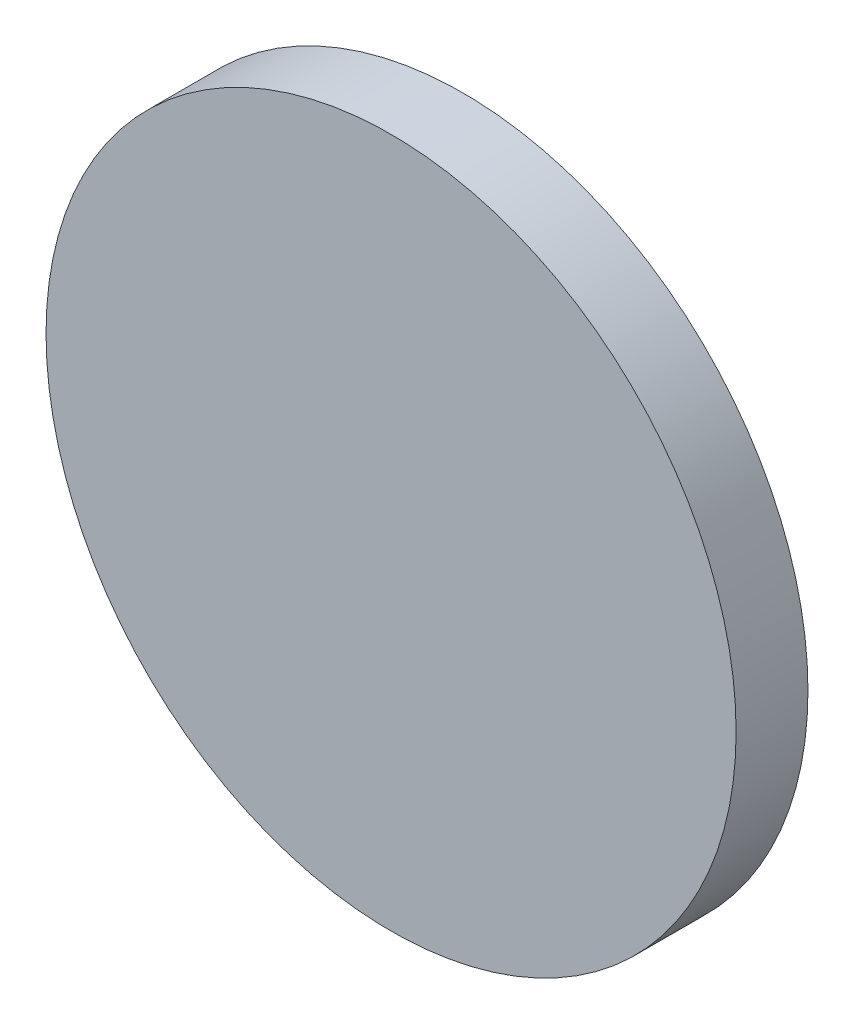
ISO-10303-21;
HEADER;
FILE_DESCRIPTION(('STEP AP214'),'2;1');
FILE_NAME('part.step','',(''),(''),'','','');
FILE_SCHEMA(('AUTOMOTIVE_DESIGN { 1 0 10303 214 1 1 1 1 }'));
ENDSEC;
DATA;
#1=APPLICATION_CONTEXT('core data for automotive mechanical design processes');
#2=APPLICATION_PROTOCOL_DEFINITION('international standard','automotive_design',2000,#1);
#3=PRODUCT_CONTEXT('',#1,'mechanical');
#4=PRODUCT('Part','Part','',(#3));
#5=PRODUCT_RELATED_PRODUCT_CATEGORY('part','',(#4));
#6=PRODUCT_DEFINITION_FORMATION('','',#4);
#7=PRODUCT_DEFINITION_CONTEXT('part definition',#1,'design');
#8=PRODUCT_DEFINITION('design','',#6,#7);
#9=PRODUCT_DEFINITION_SHAPE('','',#8);
#10=(LENGTH_UNIT() NAMED_UNIT(*) SI_UNIT(.MILLI.,.METRE.));
#11=(NAMED_UNIT(*) PLANE_ANGLE_UNIT() SI_UNIT($,.RADIAN.));
#12=(NAMED_UNIT(*) SI_UNIT($,.STERADIAN.) SOLID_ANGLE_UNIT());
#13=UNCERTAINTY_MEASURE_WITH_UNIT(LENGTH_MEASURE(1.E-05),#10,'distance_accuracy_value','');
#14=(GEOMETRIC_REPRESENTATION_CONTEXT(3) GLOBAL_UNCERTAINTY_ASSIGNED_CONTEXT((#13)) GLOBAL_UNIT_ASSIGNED_CONTEXT((#10,
#11,#12)) REPRESENTATION_CONTEXT('',''));
#15=CARTESIAN_POINT('',(0.,0.,0.));
#16=DIRECTION('',(0.,0.,1.));
#17=DIRECTION('',(1.,0.,0.));
#18=AXIS2_PLACEMENT_3D('',#15,#16,#17);
#19=CARTESIAN_POINT('',(0.,0.,8.85));
#20=DIRECTION('',(0.,0.,-1.));
#21=DIRECTION('',(-1.,0.,0.));
#22=AXIS2_PLACEMENT_3D('',#19,#20,#21);
#23=CYLINDRICAL_SURFACE('',#22,42.5);
#24=CARTESIAN_POINT('',(0.,0.,8.85));
#25=DIRECTION('',(0.,0.,1.));
#26=DIRECTION('',(1.,0.,0.));
#27=AXIS2_PLACEMENT_3D('',#24,#25,#26);
#28=CIRCLE('',#27,42.5);
#29=CARTESIAN_POINT('',(42.5,0.,8.85));
#30=VERTEX_POINT('',#29);
#31=EDGE_CURVE('E10',#30,#30,#28,.T.);
#32=ORIENTED_EDGE('',*,*,#31,.F.);
#33=EDGE_LOOP('',(#32));
#34=FACE_BOUND('',#33,.T.);
#35=CARTESIAN_POINT('',(0.,0.,0.));
#36=DIRECTION('',(0.,0.,1.));
#37=DIRECTION('',(1.,0.,0.));
#38=AXIS2_PLACEMENT_3D('',#35,#36,#37);
#39=CIRCLE('',#38,42.5);
#40=CARTESIAN_POINT('',(42.5,0.,0.));
#41=VERTEX_POINT('',#40);
#42=EDGE_CURVE('E38',#41,#41,#39,.T.);
#43=ORIENTED_EDGE('',*,*,#42,.T.);
#44=EDGE_LOOP('',(#43));
#45=FACE_BOUND('',#44,.T.);
#46=ADVANCED_FACE('F35',(#34,#45),#23,.T.);
#47=CARTESIAN_POINT('',(0.,0.,8.85));
#48=DIRECTION('',(0.,0.,1.));
#49=DIRECTION('',(1.,0.,0.));
#50=AXIS2_PLACEMENT_3D('',#47,#48,#49);
#51=PLANE('',#50);
#52=ORIENTED_EDGE('',*,*,#31,.T.);
#53=EDGE_LOOP('',(#52));
#54=FACE_BOUND('',#53,.T.);
#55=ADVANCED_FACE('F50',(#54),#51,.T.);
#56=CARTESIAN_POINT('',(0.,0.,0.));
#57=DIRECTION('',(0.,0.,1.));
#58=DIRECTION('',(1.,0.,0.));
#59=AXIS2_PLACEMENT_3D('',#56,#57,#58);
#60=PLANE('',#59);
#61=ORIENTED_EDGE('',*,*,#42,.F.);
#62=EDGE_LOOP('',(#61));
#63=FACE_BOUND('',#62,.T.);
#64=ADVANCED_FACE('F48',(#63),#60,.F.);
#65=CLOSED_SHELL('',(#46,#55,#64));
#66=MANIFOLD_SOLID_BREP('B2',#65);
#67=ADVANCED_BREP_SHAPE_REPRESENTATION('',(#18,#66),#14);
#68=SHAPE_DEFINITION_REPRESENTATION(#9,#67);
ENDSEC;
END-ISO-10303-21;
